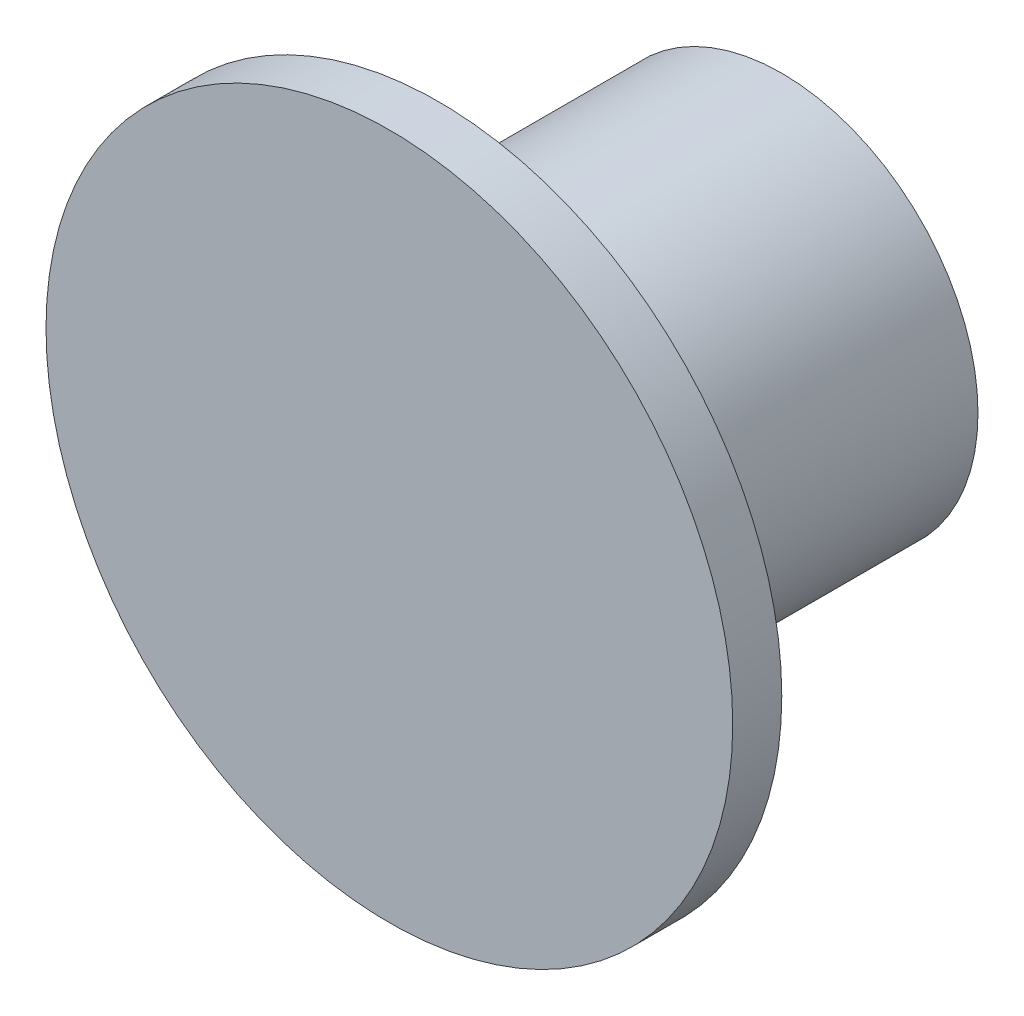
ISO-10303-21;
HEADER;
FILE_DESCRIPTION(('STEP AP214'),'2;1');
FILE_NAME('part.step','',(''),(''),'','','');
FILE_SCHEMA(('AUTOMOTIVE_DESIGN { 1 0 10303 214 1 1 1 1 }'));
ENDSEC;
DATA;
#1=APPLICATION_CONTEXT('core data for automotive mechanical design processes');
#2=APPLICATION_PROTOCOL_DEFINITION('international standard','automotive_design',2000,#1);
#3=PRODUCT_CONTEXT('',#1,'mechanical');
#4=PRODUCT('Part','Part','',(#3));
#5=PRODUCT_RELATED_PRODUCT_CATEGORY('part','',(#4));
#6=PRODUCT_DEFINITION_FORMATION('','',#4);
#7=PRODUCT_DEFINITION_CONTEXT('part definition',#1,'design');
#8=PRODUCT_DEFINITION('design','',#6,#7);
#9=PRODUCT_DEFINITION_SHAPE('','',#8);
#10=(LENGTH_UNIT() NAMED_UNIT(*) SI_UNIT(.MILLI.,.METRE.));
#11=(NAMED_UNIT(*) PLANE_ANGLE_UNIT() SI_UNIT($,.RADIAN.));
#12=(NAMED_UNIT(*) SI_UNIT($,.STERADIAN.) SOLID_ANGLE_UNIT());
#13=UNCERTAINTY_MEASURE_WITH_UNIT(LENGTH_MEASURE(1.E-05),#10,'distance_accuracy_value','');
#14=(GEOMETRIC_REPRESENTATION_CONTEXT(3) GLOBAL_UNCERTAINTY_ASSIGNED_CONTEXT((#13)) GLOBAL_UNIT_ASSIGNED_CONTEXT((#10,
#11,#12)) REPRESENTATION_CONTEXT('',''));
#15=CARTESIAN_POINT('',(0.,0.,0.));
#16=DIRECTION('',(0.,0.,1.));
#17=DIRECTION('',(1.,0.,0.));
#18=AXIS2_PLACEMENT_3D('',#15,#16,#17);
#19=CARTESIAN_POINT('',(0.,0.,7.));
#20=DIRECTION('',(0.,0.,-1.));
#21=DIRECTION('',(-1.,0.,0.));
#22=AXIS2_PLACEMENT_3D('',#19,#20,#21);
#23=CYLINDRICAL_SURFACE('',#22,4.);
#24=CARTESIAN_POINT('',(0.,0.,7.));
#25=DIRECTION('',(0.,0.,1.));
#26=DIRECTION('',(1.,0.,0.));
#27=AXIS2_PLACEMENT_3D('',#24,#25,#26);
#28=CIRCLE('',#27,4.);
#29=CARTESIAN_POINT('',(4.,0.,7.));
#30=VERTEX_POINT('',#29);
#31=EDGE_CURVE('E10',#30,#30,#28,.T.);
#32=ORIENTED_EDGE('',*,*,#31,.F.);
#33=EDGE_LOOP('',(#32));
#34=FACE_BOUND('',#33,.T.);
#35=CARTESIAN_POINT('',(0.,0.,0.));
#36=DIRECTION('',(0.,0.,1.));
#37=DIRECTION('',(1.,0.,0.));
#38=AXIS2_PLACEMENT_3D('',#35,#36,#37);
#39=CIRCLE('',#38,4.);
#40=CARTESIAN_POINT('',(4.,0.,0.));
#41=VERTEX_POINT('',#40);
#42=EDGE_CURVE('E40',#41,#41,#39,.T.);
#43=ORIENTED_EDGE('',*,*,#42,.T.);
#44=EDGE_LOOP('',(#43));
#45=FACE_BOUND('',#44,.T.);
#46=ADVANCED_FACE('F37',(#34,#45),#23,.T.);
#47=CARTESIAN_POINT('',(0.,0.,0.));
#48=DIRECTION('',(0.,0.,1.));
#49=DIRECTION('',(1.,0.,0.));
#50=AXIS2_PLACEMENT_3D('',#47,#48,#49);
#51=PLANE('',#50);
#52=ORIENTED_EDGE('',*,*,#42,.F.);
#53=EDGE_LOOP('',(#52));
#54=FACE_BOUND('',#53,.T.);
#55=ADVANCED_FACE('F64',(#54),#51,.F.);
#56=CARTESIAN_POINT('',(0.,0.,8.));
#57=DIRECTION('',(0.,0.,-1.));
#58=DIRECTION('',(-1.,0.,0.));
#59=AXIS2_PLACEMENT_3D('',#56,#57,#58);
#60=CYLINDRICAL_SURFACE('',#59,7.);
#61=CARTESIAN_POINT('',(0.,0.,8.));
#62=DIRECTION('',(0.,0.,1.));
#63=DIRECTION('',(1.,0.,0.));
#64=AXIS2_PLACEMENT_3D('',#61,#62,#63);
#65=CIRCLE('',#64,7.);
#66=CARTESIAN_POINT('',(7.,0.,8.));
#67=VERTEX_POINT('',#66);
#68=EDGE_CURVE('E49',#67,#67,#65,.T.);
#69=ORIENTED_EDGE('',*,*,#68,.F.);
#70=EDGE_LOOP('',(#69));
#71=FACE_BOUND('',#70,.T.);
#72=CARTESIAN_POINT('',(0.,0.,7.));
#73=DIRECTION('',(0.,0.,1.));
#74=DIRECTION('',(1.,0.,0.));
#75=AXIS2_PLACEMENT_3D('',#72,#73,#74);
#76=CIRCLE('',#75,7.);
#77=CARTESIAN_POINT('',(7.,0.,7.));
#78=VERTEX_POINT('',#77);
#79=EDGE_CURVE('E51',#78,#78,#76,.T.);
#80=ORIENTED_EDGE('',*,*,#79,.T.);
#81=EDGE_LOOP('',(#80));
#82=FACE_BOUND('',#81,.T.);
#83=ADVANCED_FACE('F61',(#71,#82),#60,.T.);
#84=CARTESIAN_POINT('',(0.,0.,8.));
#85=DIRECTION('',(0.,0.,1.));
#86=DIRECTION('',(1.,0.,0.));
#87=AXIS2_PLACEMENT_3D('',#84,#85,#86);
#88=PLANE('',#87);
#89=ORIENTED_EDGE('',*,*,#68,.T.);
#90=EDGE_LOOP('',(#89));
#91=FACE_BOUND('',#90,.T.);
#92=ADVANCED_FACE('F59',(#91),#88,.T.);
#93=CARTESIAN_POINT('',(0.,0.,7.));
#94=DIRECTION('',(0.,0.,1.));
#95=DIRECTION('',(1.,0.,0.));
#96=AXIS2_PLACEMENT_3D('',#93,#94,#95);
#97=PLANE('',#96);
#98=ORIENTED_EDGE('',*,*,#31,.T.);
#99=EDGE_LOOP('',(#98));
#100=FACE_BOUND('',#99,.T.);
#101=ORIENTED_EDGE('',*,*,#79,.F.);
#102=EDGE_LOOP('',(#101));
#103=FACE_BOUND('',#102,.T.);
#104=ADVANCED_FACE('F68',(#100,#103),#97,.F.);
#105=CLOSED_SHELL('',(#46,#55,#83,#92,#104));
#106=MANIFOLD_SOLID_BREP('B2',#105);
#107=ADVANCED_BREP_SHAPE_REPRESENTATION('',(#18,#106),#14);
#108=SHAPE_DEFINITION_REPRESENTATION(#9,#107);
ENDSEC;
END-ISO-10303-21;
